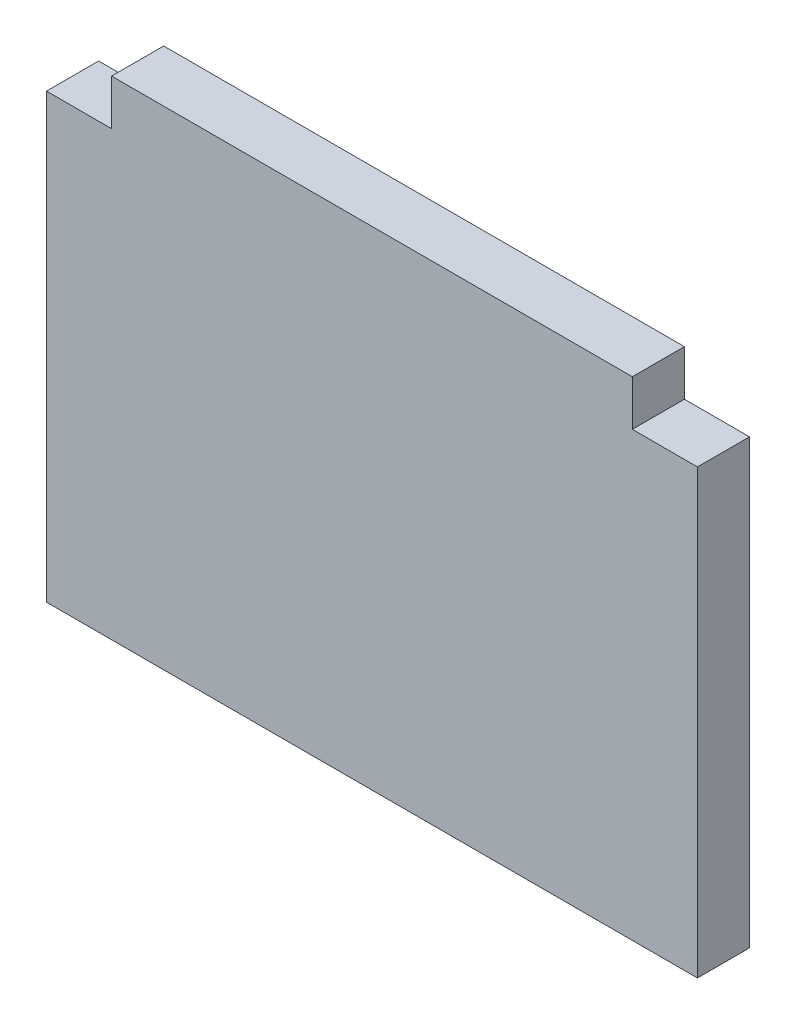
ISO-10303-21;
HEADER;
FILE_DESCRIPTION(('STEP AP214'),'2;1');
FILE_NAME('part.step','',(''),(''),'','','');
FILE_SCHEMA(('AUTOMOTIVE_DESIGN { 1 0 10303 214 1 1 1 1 }'));
ENDSEC;
DATA;
#1=APPLICATION_CONTEXT('core data for automotive mechanical design processes');
#2=APPLICATION_PROTOCOL_DEFINITION('international standard','automotive_design',2000,#1);
#3=PRODUCT_CONTEXT('',#1,'mechanical');
#4=PRODUCT('Part','Part','',(#3));
#5=PRODUCT_RELATED_PRODUCT_CATEGORY('part','',(#4));
#6=PRODUCT_DEFINITION_FORMATION('','',#4);
#7=PRODUCT_DEFINITION_CONTEXT('part definition',#1,'design');
#8=PRODUCT_DEFINITION('design','',#6,#7);
#9=PRODUCT_DEFINITION_SHAPE('','',#8);
#10=(LENGTH_UNIT() NAMED_UNIT(*) SI_UNIT(.MILLI.,.METRE.));
#11=(NAMED_UNIT(*) PLANE_ANGLE_UNIT() SI_UNIT($,.RADIAN.));
#12=(NAMED_UNIT(*) SI_UNIT($,.STERADIAN.) SOLID_ANGLE_UNIT());
#13=UNCERTAINTY_MEASURE_WITH_UNIT(LENGTH_MEASURE(1.E-05),#10,'distance_accuracy_value','');
#14=(GEOMETRIC_REPRESENTATION_CONTEXT(3) GLOBAL_UNCERTAINTY_ASSIGNED_CONTEXT((#13)) GLOBAL_UNIT_ASSIGNED_CONTEXT((#10,
#11,#12)) REPRESENTATION_CONTEXT('',''));
#15=CARTESIAN_POINT('',(0.,0.,0.));
#16=DIRECTION('',(0.,0.,1.));
#17=DIRECTION('',(1.,0.,0.));
#18=AXIS2_PLACEMENT_3D('',#15,#16,#17);
#19=CARTESIAN_POINT('',(0.500000000000001,-1.93602540378444,0.));
#20=DIRECTION('',(1.,0.,0.));
#21=DIRECTION('',(0.,1.,0.));
#22=AXIS2_PLACEMENT_3D('',#19,#20,#21);
#23=PLANE('',#22);
#24=DIRECTION('',(0.,1.,0.));
#25=VECTOR('',#24,1.);
#26=CARTESIAN_POINT('',(0.500000000000001,-1.93602540378444,0.08));
#27=LINE('',#26,#25);
#28=CARTESIAN_POINT('',(0.500000000000001,-2.61602540378444,0.08));
#29=VERTEX_POINT('',#28);
#30=CARTESIAN_POINT('',(0.500000000000001,-1.93602540378444,0.08));
#31=VERTEX_POINT('',#30);
#32=EDGE_CURVE('E130',#29,#31,#27,.T.);
#33=ORIENTED_EDGE('',*,*,#32,.F.);
#34=DIRECTION('',(0.,0.,1.));
#35=VECTOR('',#34,1.);
#36=CARTESIAN_POINT('',(0.500000000000001,-2.61602540378444,0.));
#37=LINE('',#36,#35);
#38=CARTESIAN_POINT('',(0.500000000000001,-2.61602540378444,0.));
#39=VERTEX_POINT('',#38);
#40=EDGE_CURVE('E11',#39,#29,#37,.T.);
#41=ORIENTED_EDGE('',*,*,#40,.F.);
#42=DIRECTION('',(0.,1.,0.));
#43=VECTOR('',#42,1.);
#44=CARTESIAN_POINT('',(0.500000000000001,-1.93602540378444,0.));
#45=LINE('',#44,#43);
#46=CARTESIAN_POINT('',(0.500000000000001,-1.93602540378444,0.));
#47=VERTEX_POINT('',#46);
#48=EDGE_CURVE('E150',#39,#47,#45,.T.);
#49=ORIENTED_EDGE('',*,*,#48,.T.);
#50=DIRECTION('',(0.,0.,1.));
#51=VECTOR('',#50,1.);
#52=CARTESIAN_POINT('',(0.500000000000001,-1.93602540378444,0.));
#53=LINE('',#52,#51);
#54=EDGE_CURVE('E36',#47,#31,#53,.T.);
#55=ORIENTED_EDGE('',*,*,#54,.T.);
#56=EDGE_LOOP('',(#33,#41,#49,#55));
#57=FACE_BOUND('',#56,.T.);
#58=ADVANCED_FACE('F33',(#57),#23,.T.);
#59=CARTESIAN_POINT('',(-0.499999999999999,-2.61602540378444,0.));
#60=DIRECTION('',(0.,-1.,0.));
#61=DIRECTION('',(1.,0.,0.));
#62=AXIS2_PLACEMENT_3D('',#59,#60,#61);
#63=PLANE('',#62);
#64=DIRECTION('',(1.,0.,0.));
#65=VECTOR('',#64,1.);
#66=CARTESIAN_POINT('',(-0.499999999999999,-2.61602540378444,0.08));
#67=LINE('',#66,#65);
#68=CARTESIAN_POINT('',(-0.499999999999999,-2.61602540378444,0.08));
#69=VERTEX_POINT('',#68);
#70=EDGE_CURVE('E148',#69,#29,#67,.T.);
#71=ORIENTED_EDGE('',*,*,#70,.F.);
#72=DIRECTION('',(0.,0.,1.));
#73=VECTOR('',#72,1.);
#74=CARTESIAN_POINT('',(-0.499999999999999,-2.61602540378444,0.));
#75=LINE('',#74,#73);
#76=CARTESIAN_POINT('',(-0.499999999999999,-2.61602540378444,0.));
#77=VERTEX_POINT('',#76);
#78=EDGE_CURVE('E42',#77,#69,#75,.T.);
#79=ORIENTED_EDGE('',*,*,#78,.F.);
#80=DIRECTION('',(1.,0.,0.));
#81=VECTOR('',#80,1.);
#82=CARTESIAN_POINT('',(-0.499999999999999,-2.61602540378444,0.));
#83=LINE('',#82,#81);
#84=EDGE_CURVE('E120',#77,#39,#83,.T.);
#85=ORIENTED_EDGE('',*,*,#84,.T.);
#86=ORIENTED_EDGE('',*,*,#40,.T.);
#87=EDGE_LOOP('',(#71,#79,#85,#86));
#88=FACE_BOUND('',#87,.T.);
#89=ADVANCED_FACE('F162',(#88),#63,.T.);
#90=CARTESIAN_POINT('',(-0.499999999999999,-1.93602540378444,0.));
#91=DIRECTION('',(-1.,0.,0.));
#92=DIRECTION('',(0.,-1.,0.));
#93=AXIS2_PLACEMENT_3D('',#90,#91,#92);
#94=PLANE('',#93);
#95=DIRECTION('',(0.,-1.,0.));
#96=VECTOR('',#95,1.);
#97=CARTESIAN_POINT('',(-0.499999999999999,-1.93602540378444,0.08));
#98=LINE('',#97,#96);
#99=CARTESIAN_POINT('',(-0.499999999999999,-1.93602540378444,0.08));
#100=VERTEX_POINT('',#99);
#101=EDGE_CURVE('E107',#100,#69,#98,.T.);
#102=ORIENTED_EDGE('',*,*,#101,.F.);
#103=DIRECTION('',(0.,0.,1.));
#104=VECTOR('',#103,1.);
#105=CARTESIAN_POINT('',(-0.499999999999999,-1.93602540378444,0.));
#106=LINE('',#105,#104);
#107=CARTESIAN_POINT('',(-0.499999999999999,-1.93602540378444,0.));
#108=VERTEX_POINT('',#107);
#109=EDGE_CURVE('E102',#108,#100,#106,.T.);
#110=ORIENTED_EDGE('',*,*,#109,.F.);
#111=DIRECTION('',(0.,-1.,0.));
#112=VECTOR('',#111,1.);
#113=CARTESIAN_POINT('',(-0.499999999999999,-1.93602540378444,0.));
#114=LINE('',#113,#112);
#115=EDGE_CURVE('E105',#108,#77,#114,.T.);
#116=ORIENTED_EDGE('',*,*,#115,.T.);
#117=ORIENTED_EDGE('',*,*,#78,.T.);
#118=EDGE_LOOP('',(#102,#110,#116,#117));
#119=FACE_BOUND('',#118,.T.);
#120=ADVANCED_FACE('F104',(#119),#94,.T.);
#121=CARTESIAN_POINT('',(-0.499999999999999,-1.93602540378444,0.));
#122=DIRECTION('',(0.,1.,0.));
#123=DIRECTION('',(-1.,0.,0.));
#124=AXIS2_PLACEMENT_3D('',#121,#122,#123);
#125=PLANE('',#124);
#126=DIRECTION('',(-1.,0.,0.));
#127=VECTOR('',#126,1.);
#128=CARTESIAN_POINT('',(-0.499999999999999,-1.93602540378444,0.08));
#129=LINE('',#128,#127);
#130=CARTESIAN_POINT('',(-0.399999999999999,-1.93602540378444,0.08));
#131=VERTEX_POINT('',#130);
#132=EDGE_CURVE('E145',#131,#100,#129,.T.);
#133=ORIENTED_EDGE('',*,*,#132,.F.);
#134=DIRECTION('',(0.,0.,1.));
#135=VECTOR('',#134,1.);
#136=CARTESIAN_POINT('',(-0.399999999999999,-1.93602540378444,0.));
#137=LINE('',#136,#135);
#138=CARTESIAN_POINT('',(-0.399999999999999,-1.93602540378444,0.));
#139=VERTEX_POINT('',#138);
#140=EDGE_CURVE('E112',#139,#131,#137,.T.);
#141=ORIENTED_EDGE('',*,*,#140,.F.);
#142=DIRECTION('',(-1.,0.,0.));
#143=VECTOR('',#142,1.);
#144=CARTESIAN_POINT('',(-0.499999999999999,-1.93602540378444,0.));
#145=LINE('',#144,#143);
#146=EDGE_CURVE('E118',#139,#108,#145,.T.);
#147=ORIENTED_EDGE('',*,*,#146,.T.);
#148=ORIENTED_EDGE('',*,*,#109,.T.);
#149=EDGE_LOOP('',(#133,#141,#147,#148));
#150=FACE_BOUND('',#149,.T.);
#151=ADVANCED_FACE('F122',(#150),#125,.T.);
#152=CARTESIAN_POINT('',(-0.399999999999999,-1.93602540378444,0.));
#153=DIRECTION('',(-1.,0.,0.));
#154=DIRECTION('',(0.,-1.,0.));
#155=AXIS2_PLACEMENT_3D('',#152,#153,#154);
#156=PLANE('',#155);
#157=DIRECTION('',(0.,-1.,0.));
#158=VECTOR('',#157,1.);
#159=CARTESIAN_POINT('',(-0.399999999999999,-1.93602540378444,0.08));
#160=LINE('',#159,#158);
#161=CARTESIAN_POINT('',(-0.399999999999999,-1.86602540378444,0.08));
#162=VERTEX_POINT('',#161);
#163=EDGE_CURVE('E142',#162,#131,#160,.T.);
#164=ORIENTED_EDGE('',*,*,#163,.F.);
#165=DIRECTION('',(0.,0.,1.));
#166=VECTOR('',#165,1.);
#167=CARTESIAN_POINT('',(-0.399999999999999,-1.86602540378444,0.));
#168=LINE('',#167,#166);
#169=CARTESIAN_POINT('',(-0.399999999999999,-1.86602540378444,0.));
#170=VERTEX_POINT('',#169);
#171=EDGE_CURVE('E154',#170,#162,#168,.T.);
#172=ORIENTED_EDGE('',*,*,#171,.F.);
#173=DIRECTION('',(0.,-1.,0.));
#174=VECTOR('',#173,1.);
#175=CARTESIAN_POINT('',(-0.399999999999999,-1.93602540378444,0.));
#176=LINE('',#175,#174);
#177=EDGE_CURVE('E123',#170,#139,#176,.T.);
#178=ORIENTED_EDGE('',*,*,#177,.T.);
#179=ORIENTED_EDGE('',*,*,#140,.T.);
#180=EDGE_LOOP('',(#164,#172,#178,#179));
#181=FACE_BOUND('',#180,.T.);
#182=ADVANCED_FACE('F175',(#181),#156,.T.);
#183=CARTESIAN_POINT('',(-0.399999999999999,-1.86602540378444,0.));
#184=DIRECTION('',(0.,1.,0.));
#185=DIRECTION('',(-1.,0.,0.));
#186=AXIS2_PLACEMENT_3D('',#183,#184,#185);
#187=PLANE('',#186);
#188=DIRECTION('',(-1.,0.,0.));
#189=VECTOR('',#188,1.);
#190=CARTESIAN_POINT('',(-0.399999999999999,-1.86602540378444,0.08));
#191=LINE('',#190,#189);
#192=CARTESIAN_POINT('',(0.400000000000001,-1.86602540378444,0.08));
#193=VERTEX_POINT('',#192);
#194=EDGE_CURVE('E139',#193,#162,#191,.T.);
#195=ORIENTED_EDGE('',*,*,#194,.F.);
#196=DIRECTION('',(0.,0.,1.));
#197=VECTOR('',#196,1.);
#198=CARTESIAN_POINT('',(0.400000000000001,-1.86602540378444,0.));
#199=LINE('',#198,#197);
#200=CARTESIAN_POINT('',(0.400000000000001,-1.86602540378444,0.));
#201=VERTEX_POINT('',#200);
#202=EDGE_CURVE('E156',#201,#193,#199,.T.);
#203=ORIENTED_EDGE('',*,*,#202,.F.);
#204=DIRECTION('',(-1.,0.,0.));
#205=VECTOR('',#204,1.);
#206=CARTESIAN_POINT('',(-0.399999999999999,-1.86602540378444,0.));
#207=LINE('',#206,#205);
#208=EDGE_CURVE('E125',#201,#170,#207,.T.);
#209=ORIENTED_EDGE('',*,*,#208,.T.);
#210=ORIENTED_EDGE('',*,*,#171,.T.);
#211=EDGE_LOOP('',(#195,#203,#209,#210));
#212=FACE_BOUND('',#211,.T.);
#213=ADVANCED_FACE('F178',(#212),#187,.T.);
#214=CARTESIAN_POINT('',(0.400000000000001,-1.93602540378444,0.));
#215=DIRECTION('',(1.,0.,0.));
#216=DIRECTION('',(0.,1.,0.));
#217=AXIS2_PLACEMENT_3D('',#214,#215,#216);
#218=PLANE('',#217);
#219=DIRECTION('',(0.,1.,0.));
#220=VECTOR('',#219,1.);
#221=CARTESIAN_POINT('',(0.400000000000001,-1.93602540378444,0.08));
#222=LINE('',#221,#220);
#223=CARTESIAN_POINT('',(0.400000000000001,-1.93602540378444,0.08));
#224=VERTEX_POINT('',#223);
#225=EDGE_CURVE('E136',#224,#193,#222,.T.);
#226=ORIENTED_EDGE('',*,*,#225,.F.);
#227=DIRECTION('',(0.,0.,1.));
#228=VECTOR('',#227,1.);
#229=CARTESIAN_POINT('',(0.400000000000001,-1.93602540378444,0.));
#230=LINE('',#229,#228);
#231=CARTESIAN_POINT('',(0.400000000000001,-1.93602540378444,0.));
#232=VERTEX_POINT('',#231);
#233=EDGE_CURVE('E157',#232,#224,#230,.T.);
#234=ORIENTED_EDGE('',*,*,#233,.F.);
#235=DIRECTION('',(0.,1.,0.));
#236=VECTOR('',#235,1.);
#237=CARTESIAN_POINT('',(0.400000000000001,-1.93602540378444,0.));
#238=LINE('',#237,#236);
#239=EDGE_CURVE('E253',#232,#201,#238,.T.);
#240=ORIENTED_EDGE('',*,*,#239,.T.);
#241=ORIENTED_EDGE('',*,*,#202,.T.);
#242=EDGE_LOOP('',(#226,#234,#240,#241));
#243=FACE_BOUND('',#242,.T.);
#244=ADVANCED_FACE('F182',(#243),#218,.T.);
#245=CARTESIAN_POINT('',(0.500000000000001,-1.93602540378444,0.));
#246=DIRECTION('',(0.,1.,0.));
#247=DIRECTION('',(-1.,0.,0.));
#248=AXIS2_PLACEMENT_3D('',#245,#246,#247);
#249=PLANE('',#248);
#250=DIRECTION('',(-1.,0.,0.));
#251=VECTOR('',#250,1.);
#252=CARTESIAN_POINT('',(0.500000000000001,-1.93602540378444,0.08));
#253=LINE('',#252,#251);
#254=EDGE_CURVE('E133',#31,#224,#253,.T.);
#255=ORIENTED_EDGE('',*,*,#254,.F.);
#256=ORIENTED_EDGE('',*,*,#54,.F.);
#257=DIRECTION('',(-1.,0.,0.));
#258=VECTOR('',#257,1.);
#259=CARTESIAN_POINT('',(0.500000000000001,-1.93602540378444,0.));
#260=LINE('',#259,#258);
#261=EDGE_CURVE('E254',#47,#232,#260,.T.);
#262=ORIENTED_EDGE('',*,*,#261,.T.);
#263=ORIENTED_EDGE('',*,*,#233,.T.);
#264=EDGE_LOOP('',(#255,#256,#262,#263));
#265=FACE_BOUND('',#264,.T.);
#266=ADVANCED_FACE('F159',(#265),#249,.T.);
#267=CARTESIAN_POINT('',(0.,0.,0.));
#268=DIRECTION('',(0.,0.,1.));
#269=DIRECTION('',(1.,0.,0.));
#270=AXIS2_PLACEMENT_3D('',#267,#268,#269);
#271=PLANE('',#270);
#272=ORIENTED_EDGE('',*,*,#48,.F.);
#273=ORIENTED_EDGE('',*,*,#84,.F.);
#274=ORIENTED_EDGE('',*,*,#115,.F.);
#275=ORIENTED_EDGE('',*,*,#146,.F.);
#276=ORIENTED_EDGE('',*,*,#177,.F.);
#277=ORIENTED_EDGE('',*,*,#208,.F.);
#278=ORIENTED_EDGE('',*,*,#239,.F.);
#279=ORIENTED_EDGE('',*,*,#261,.F.);
#280=EDGE_LOOP('',(#272,#273,#274,#275,#276,#277,#278,#279));
#281=FACE_BOUND('',#280,.T.);
#282=ADVANCED_FACE('F116',(#281),#271,.F.);
#283=CARTESIAN_POINT('',(0.,0.,0.08));
#284=DIRECTION('',(0.,0.,1.));
#285=DIRECTION('',(1.,0.,0.));
#286=AXIS2_PLACEMENT_3D('',#283,#284,#285);
#287=PLANE('',#286);
#288=ORIENTED_EDGE('',*,*,#32,.T.);
#289=ORIENTED_EDGE('',*,*,#254,.T.);
#290=ORIENTED_EDGE('',*,*,#225,.T.);
#291=ORIENTED_EDGE('',*,*,#194,.T.);
#292=ORIENTED_EDGE('',*,*,#163,.T.);
#293=ORIENTED_EDGE('',*,*,#132,.T.);
#294=ORIENTED_EDGE('',*,*,#101,.T.);
#295=ORIENTED_EDGE('',*,*,#70,.T.);
#296=EDGE_LOOP('',(#288,#289,#290,#291,#292,#293,#294,#295));
#297=FACE_BOUND('',#296,.T.);
#298=ADVANCED_FACE('F161',(#297),#287,.T.);
#299=CLOSED_SHELL('',(#58,#89,#120,#151,#182,#213,#244,#266,#282,#298));
#300=MANIFOLD_SOLID_BREP('B2',#299);
#301=ADVANCED_BREP_SHAPE_REPRESENTATION('',(#18,#300),#14);
#302=SHAPE_DEFINITION_REPRESENTATION(#9,#301);
ENDSEC;
END-ISO-10303-21;
